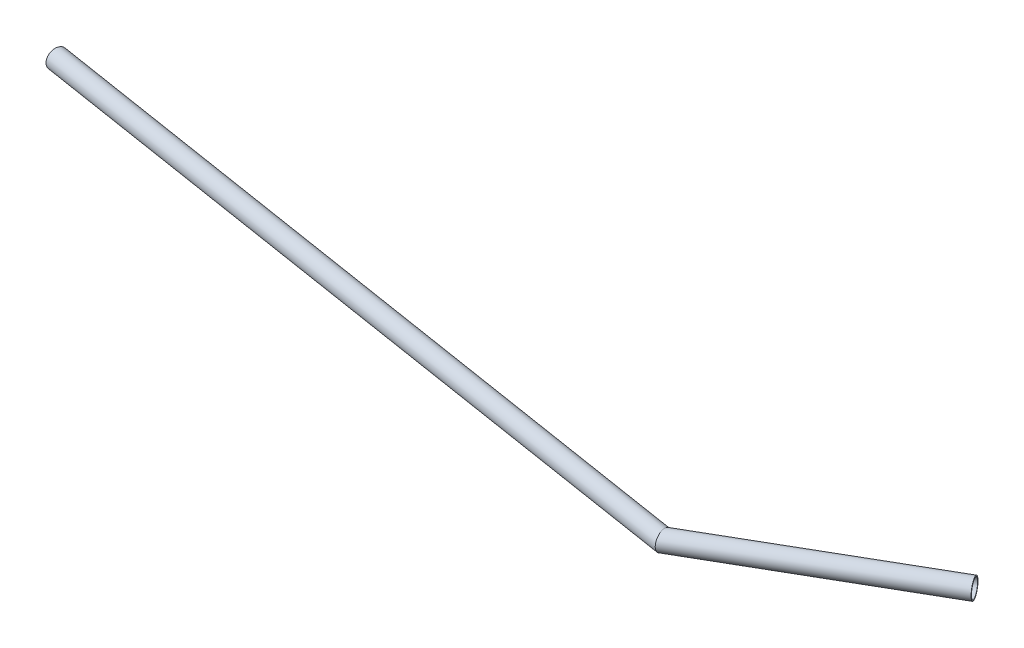
ISO-10303-21;
HEADER;
FILE_DESCRIPTION(('STEP AP214'),'2;1');
FILE_NAME('part.step','',(''),(''),'','','');
FILE_SCHEMA(('AUTOMOTIVE_DESIGN { 1 0 10303 214 1 1 1 1 }'));
ENDSEC;
DATA;
#1=APPLICATION_CONTEXT('core data for automotive mechanical design processes');
#2=APPLICATION_PROTOCOL_DEFINITION('international standard','automotive_design',2000,#1);
#3=PRODUCT_CONTEXT('',#1,'mechanical');
#4=PRODUCT('Part','Part','',(#3));
#5=PRODUCT_RELATED_PRODUCT_CATEGORY('part','',(#4));
#6=PRODUCT_DEFINITION_FORMATION('','',#4);
#7=PRODUCT_DEFINITION_CONTEXT('part definition',#1,'design');
#8=PRODUCT_DEFINITION('design','',#6,#7);
#9=PRODUCT_DEFINITION_SHAPE('','',#8);
#10=(LENGTH_UNIT() NAMED_UNIT(*) SI_UNIT(.MILLI.,.METRE.));
#11=(NAMED_UNIT(*) PLANE_ANGLE_UNIT() SI_UNIT($,.RADIAN.));
#12=(NAMED_UNIT(*) SI_UNIT($,.STERADIAN.) SOLID_ANGLE_UNIT());
#13=UNCERTAINTY_MEASURE_WITH_UNIT(LENGTH_MEASURE(1.E-05),#10,'distance_accuracy_value','');
#14=(GEOMETRIC_REPRESENTATION_CONTEXT(3) GLOBAL_UNCERTAINTY_ASSIGNED_CONTEXT((#13)) GLOBAL_UNIT_ASSIGNED_CONTEXT((#10,
#11,#12)) REPRESENTATION_CONTEXT('',''));
#15=CARTESIAN_POINT('',(0.,0.,0.));
#16=DIRECTION('',(0.,0.,1.));
#17=DIRECTION('',(1.,0.,0.));
#18=AXIS2_PLACEMENT_3D('',#15,#16,#17);
#19=CARTESIAN_POINT('',(465.,0.,-2.22044604925031E-13));
#20=DIRECTION('',(0.866025403784442,0.,-0.499999999999995));
#21=DIRECTION('',(-0.499999999999995,0.,-0.866025403784442));
#22=AXIS2_PLACEMENT_3D('',#19,#20,#21);
#23=PLANE('',#22);
#24=CARTESIAN_POINT('',(465.,0.,-2.08166817117217E-13));
#25=DIRECTION('',(0.866025403784442,0.,-0.499999999999995));
#26=DIRECTION('',(-0.499999999999995,0.,-0.866025403784442));
#27=AXIS2_PLACEMENT_3D('',#24,#25,#26);
#28=CIRCLE('',#27,8.525);
#29=CARTESIAN_POINT('',(460.7375,0.,-7.38286656726257));
#30=VERTEX_POINT('',#29);
#31=EDGE_CURVE('E60',#30,#30,#28,.T.);
#32=ORIENTED_EDGE('',*,*,#31,.F.);
#33=EDGE_LOOP('',(#32));
#34=FACE_BOUND('',#33,.T.);
#35=CARTESIAN_POINT('',(465.,0.,-2.22044604925031E-13));
#36=DIRECTION('',(0.866025403784442,0.,-0.499999999999995));
#37=DIRECTION('',(-0.499999999999995,0.,-0.866025403784442));
#38=AXIS2_PLACEMENT_3D('',#35,#36,#37);
#39=CIRCLE('',#38,9.525);
#40=CARTESIAN_POINT('',(460.2375,0.,-8.24889197104703));
#41=VERTEX_POINT('',#40);
#42=EDGE_CURVE('E43',#41,#41,#39,.T.);
#43=ORIENTED_EDGE('',*,*,#42,.T.);
#44=EDGE_LOOP('',(#43));
#45=FACE_BOUND('',#44,.T.);
#46=ADVANCED_FACE('F40',(#34,#45),#23,.T.);
#47=CARTESIAN_POINT('',(-465.,0.,0.));
#48=DIRECTION('',(0.987719801882074,0.,0.15623569684946));
#49=DIRECTION('',(0.15623569684946,0.,-0.987719801882074));
#50=AXIS2_PLACEMENT_3D('',#47,#48,#49);
#51=PLANE('',#50);
#52=CARTESIAN_POINT('',(-465.,0.,0.));
#53=DIRECTION('',(0.987719801882074,0.,0.15623569684946));
#54=DIRECTION('',(0.15623569684946,0.,-0.987719801882074));
#55=AXIS2_PLACEMENT_3D('',#52,#53,#54);
#56=CIRCLE('',#55,8.525);
#57=CARTESIAN_POINT('',(-463.668090684359,0.,-8.4203113110447));
#58=VERTEX_POINT('',#57);
#59=EDGE_CURVE('E55',#58,#58,#56,.T.);
#60=ORIENTED_EDGE('',*,*,#59,.T.);
#61=EDGE_LOOP('',(#60));
#62=FACE_BOUND('',#61,.T.);
#63=CARTESIAN_POINT('',(-465.,0.,0.));
#64=DIRECTION('',(0.987719801882074,0.,0.15623569684946));
#65=DIRECTION('',(0.15623569684946,0.,-0.987719801882074));
#66=AXIS2_PLACEMENT_3D('',#63,#64,#65);
#67=CIRCLE('',#66,9.525);
#68=CARTESIAN_POINT('',(-463.511854987509,0.,-9.40803111292677));
#69=VERTEX_POINT('',#68);
#70=EDGE_CURVE('E48',#69,#69,#67,.T.);
#71=ORIENTED_EDGE('',*,*,#70,.F.);
#72=EDGE_LOOP('',(#71));
#73=FACE_BOUND('',#72,.T.);
#74=ADVANCED_FACE('F76',(#62,#73),#51,.F.);
#75=CARTESIAN_POINT('',(261.701230496363,0.,117.374599298843));
#76=DIRECTION('',(0.866025403784442,0.,-0.499999999999995));
#77=DIRECTION('',(-0.499999999999995,0.,-0.866025403784442));
#78=AXIS2_PLACEMENT_3D('',#75,#76,#77);
#79=CYLINDRICAL_SURFACE('',#78,9.525);
#80=CARTESIAN_POINT('',(265.,0.,115.470053837923));
#81=DIRECTION('',(0.983236565805895,0.,-0.182334460983736));
#82=DIRECTION('',(0.182334460983736,0.,0.983236565805895));
#83=AXIS2_PLACEMENT_3D('',#80,#81,#82);
#84=ELLIPSE('',#83,10.1042238821962,9.525);
#85=CARTESIAN_POINT('',(266.842348215219,0.,125.404896227988));
#86=VERTEX_POINT('',#85);
#87=EDGE_CURVE('E10',#86,#86,#84,.F.);
#88=ORIENTED_EDGE('',*,*,#87,.F.);
#89=EDGE_LOOP('',(#88));
#90=FACE_BOUND('',#89,.T.);
#91=ORIENTED_EDGE('',*,*,#42,.F.);
#92=EDGE_LOOP('',(#91));
#93=FACE_BOUND('',#92,.T.);
#94=ADVANCED_FACE('F73',(#90,#93),#79,.T.);
#95=CARTESIAN_POINT('',(-465.,0.,0.));
#96=DIRECTION('',(0.987719801882074,0.,0.15623569684946));
#97=DIRECTION('',(0.15623569684946,0.,-0.987719801882074));
#98=AXIS2_PLACEMENT_3D('',#95,#96,#97);
#99=CYLINDRICAL_SURFACE('',#98,9.525);
#100=ORIENTED_EDGE('',*,*,#70,.T.);
#101=EDGE_LOOP('',(#100));
#102=FACE_BOUND('',#101,.T.);
#103=ORIENTED_EDGE('',*,*,#87,.T.);
#104=EDGE_LOOP('',(#103));
#105=FACE_BOUND('',#104,.T.);
#106=ADVANCED_FACE('F75',(#102,#105),#99,.T.);
#107=CARTESIAN_POINT('',(261.701230496363,0.,117.374599298843));
#108=DIRECTION('',(0.866025403784442,0.,-0.499999999999995));
#109=DIRECTION('',(-0.499999999999995,0.,-0.866025403784442));
#110=AXIS2_PLACEMENT_3D('',#107,#108,#109);
#111=CYLINDRICAL_SURFACE('',#110,8.525);
#112=CARTESIAN_POINT('',(265.,0.,115.470053837923));
#113=DIRECTION('',(0.983236565805895,0.,-0.182334460983736));
#114=DIRECTION('',(0.182334460983736,0.,0.983236565805895));
#115=AXIS2_PLACEMENT_3D('',#112,#113,#114);
#116=ELLIPSE('',#115,9.04341297592888,8.525);
#117=CARTESIAN_POINT('',(266.648925830419,0.,124.36186815554));
#118=VERTEX_POINT('',#117);
#119=EDGE_CURVE('E59',#118,#118,#116,.F.);
#120=ORIENTED_EDGE('',*,*,#119,.T.);
#121=EDGE_LOOP('',(#120));
#122=FACE_BOUND('',#121,.T.);
#123=ORIENTED_EDGE('',*,*,#31,.T.);
#124=EDGE_LOOP('',(#123));
#125=FACE_BOUND('',#124,.T.);
#126=ADVANCED_FACE('F83',(#122,#125),#111,.F.);
#127=CARTESIAN_POINT('',(-465.,0.,0.));
#128=DIRECTION('',(0.987719801882074,0.,0.15623569684946));
#129=DIRECTION('',(0.15623569684946,0.,-0.987719801882074));
#130=AXIS2_PLACEMENT_3D('',#127,#128,#129);
#131=CYLINDRICAL_SURFACE('',#130,8.525);
#132=ORIENTED_EDGE('',*,*,#59,.F.);
#133=EDGE_LOOP('',(#132));
#134=FACE_BOUND('',#133,.T.);
#135=ORIENTED_EDGE('',*,*,#119,.F.);
#136=EDGE_LOOP('',(#135));
#137=FACE_BOUND('',#136,.T.);
#138=ADVANCED_FACE('F88',(#134,#137),#131,.F.);
#139=CLOSED_SHELL('',(#46,#74,#94,#106,#126,#138));
#140=MANIFOLD_SOLID_BREP('B2',#139);
#141=ADVANCED_BREP_SHAPE_REPRESENTATION('',(#18,#140),#14);
#142=SHAPE_DEFINITION_REPRESENTATION(#9,#141);
ENDSEC;
END-ISO-10303-21;
